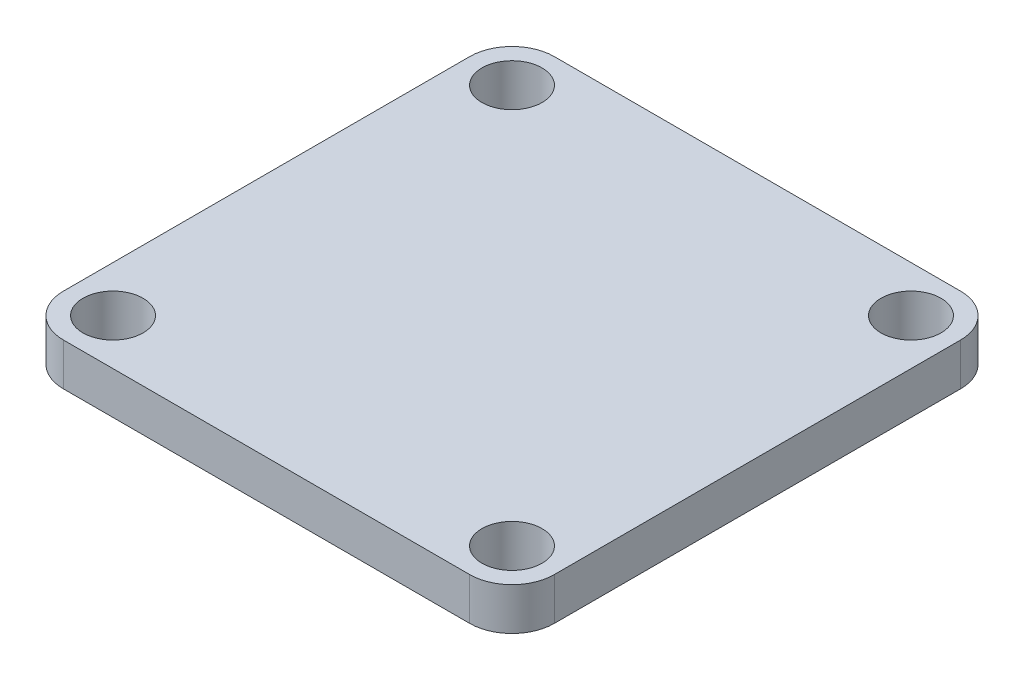
ISO-10303-21;
HEADER;
FILE_DESCRIPTION(('STEP AP214'),'2;1');
FILE_NAME('part.step','',(''),(''),'','','');
FILE_SCHEMA(('AUTOMOTIVE_DESIGN { 1 0 10303 214 1 1 1 1 }'));
ENDSEC;
DATA;
#1=APPLICATION_CONTEXT('core data for automotive mechanical design processes');
#2=APPLICATION_PROTOCOL_DEFINITION('international standard','automotive_design',2000,#1);
#3=PRODUCT_CONTEXT('',#1,'mechanical');
#4=PRODUCT('Part','Part','',(#3));
#5=PRODUCT_RELATED_PRODUCT_CATEGORY('part','',(#4));
#6=PRODUCT_DEFINITION_FORMATION('','',#4);
#7=PRODUCT_DEFINITION_CONTEXT('part definition',#1,'design');
#8=PRODUCT_DEFINITION('design','',#6,#7);
#9=PRODUCT_DEFINITION_SHAPE('','',#8);
#10=(LENGTH_UNIT() NAMED_UNIT(*) SI_UNIT(.MILLI.,.METRE.));
#11=(NAMED_UNIT(*) PLANE_ANGLE_UNIT() SI_UNIT($,.RADIAN.));
#12=(NAMED_UNIT(*) SI_UNIT($,.STERADIAN.) SOLID_ANGLE_UNIT());
#13=UNCERTAINTY_MEASURE_WITH_UNIT(LENGTH_MEASURE(1.E-05),#10,'distance_accuracy_value','');
#14=(GEOMETRIC_REPRESENTATION_CONTEXT(3) GLOBAL_UNCERTAINTY_ASSIGNED_CONTEXT((#13)) GLOBAL_UNIT_ASSIGNED_CONTEXT((#10,
#11,#12)) REPRESENTATION_CONTEXT('',''));
#15=CARTESIAN_POINT('',(0.,0.,0.));
#16=DIRECTION('',(0.,0.,1.));
#17=DIRECTION('',(1.,0.,0.));
#18=AXIS2_PLACEMENT_3D('',#15,#16,#17);
#19=CARTESIAN_POINT('',(0.,5.,0.));
#20=DIRECTION('',(0.,-1.,0.));
#21=DIRECTION('',(0.,0.,-1.));
#22=AXIS2_PLACEMENT_3D('',#19,#20,#21);
#23=PLANE('',#22);
#24=DIRECTION('',(0.,0.,-1.));
#25=VECTOR('',#24,1.);
#26=CARTESIAN_POINT('',(29.,5.,29.));
#27=LINE('',#26,#25);
#28=CARTESIAN_POINT('',(29.,5.,24.));
#29=VERTEX_POINT('',#28);
#30=CARTESIAN_POINT('',(29.,5.,-24.));
#31=VERTEX_POINT('',#30);
#32=EDGE_CURVE('E154',#29,#31,#27,.T.);
#33=ORIENTED_EDGE('',*,*,#32,.T.);
#34=CARTESIAN_POINT('',(24.,5.,-24.));
#35=DIRECTION('',(0.,-1.,0.));
#36=DIRECTION('',(0.,0.,-1.));
#37=AXIS2_PLACEMENT_3D('',#34,#35,#36);
#38=CIRCLE('',#37,5.);
#39=CARTESIAN_POINT('',(24.,5.,-29.));
#40=VERTEX_POINT('',#39);
#41=EDGE_CURVE('E178',#31,#40,#38,.F.);
#42=ORIENTED_EDGE('',*,*,#41,.T.);
#43=DIRECTION('',(-1.,0.,0.));
#44=VECTOR('',#43,1.);
#45=CARTESIAN_POINT('',(-29.,5.,-29.));
#46=LINE('',#45,#44);
#47=CARTESIAN_POINT('',(-24.,5.,-29.));
#48=VERTEX_POINT('',#47);
#49=EDGE_CURVE('E131',#40,#48,#46,.T.);
#50=ORIENTED_EDGE('',*,*,#49,.T.);
#51=CARTESIAN_POINT('',(-24.,5.,-24.));
#52=DIRECTION('',(0.,-1.,0.));
#53=DIRECTION('',(0.,0.,-1.));
#54=AXIS2_PLACEMENT_3D('',#51,#52,#53);
#55=CIRCLE('',#54,5.);
#56=CARTESIAN_POINT('',(-29.,5.,-24.));
#57=VERTEX_POINT('',#56);
#58=EDGE_CURVE('E175',#48,#57,#55,.F.);
#59=ORIENTED_EDGE('',*,*,#58,.T.);
#60=DIRECTION('',(0.,0.,1.));
#61=VECTOR('',#60,1.);
#62=CARTESIAN_POINT('',(-29.,5.,29.));
#63=LINE('',#62,#61);
#64=CARTESIAN_POINT('',(-29.,5.,24.));
#65=VERTEX_POINT('',#64);
#66=EDGE_CURVE('E204',#57,#65,#63,.T.);
#67=ORIENTED_EDGE('',*,*,#66,.T.);
#68=CARTESIAN_POINT('',(-24.,5.,24.));
#69=DIRECTION('',(0.,-1.,0.));
#70=DIRECTION('',(0.,0.,-1.));
#71=AXIS2_PLACEMENT_3D('',#68,#69,#70);
#72=CIRCLE('',#71,5.);
#73=CARTESIAN_POINT('',(-24.,5.,29.));
#74=VERTEX_POINT('',#73);
#75=EDGE_CURVE('E65',#65,#74,#72,.F.);
#76=ORIENTED_EDGE('',*,*,#75,.T.);
#77=DIRECTION('',(1.,0.,0.));
#78=VECTOR('',#77,1.);
#79=CARTESIAN_POINT('',(-29.,5.,29.));
#80=LINE('',#79,#78);
#81=CARTESIAN_POINT('',(24.,5.,29.));
#82=VERTEX_POINT('',#81);
#83=EDGE_CURVE('E156',#74,#82,#80,.T.);
#84=ORIENTED_EDGE('',*,*,#83,.T.);
#85=CARTESIAN_POINT('',(24.,5.,24.));
#86=DIRECTION('',(0.,-1.,0.));
#87=DIRECTION('',(0.,0.,-1.));
#88=AXIS2_PLACEMENT_3D('',#85,#86,#87);
#89=CIRCLE('',#88,5.);
#90=EDGE_CURVE('E172',#82,#29,#89,.F.);
#91=ORIENTED_EDGE('',*,*,#90,.T.);
#92=EDGE_LOOP('',(#33,#42,#50,#59,#67,#76,#84,#91));
#93=FACE_BOUND('',#92,.T.);
#94=CARTESIAN_POINT('',(-23.57,5.,-23.57));
#95=DIRECTION('',(0.,1.,0.));
#96=DIRECTION('',(0.,0.,1.));
#97=AXIS2_PLACEMENT_3D('',#94,#95,#96);
#98=CIRCLE('',#97,3.55);
#99=CARTESIAN_POINT('',(-23.57,5.,-20.02));
#100=VERTEX_POINT('',#99);
#101=EDGE_CURVE('E148',#100,#100,#98,.T.);
#102=ORIENTED_EDGE('',*,*,#101,.F.);
#103=EDGE_LOOP('',(#102));
#104=FACE_BOUND('',#103,.T.);
#105=CARTESIAN_POINT('',(23.57,5.,-23.57));
#106=DIRECTION('',(0.,1.,0.));
#107=DIRECTION('',(0.,0.,1.));
#108=AXIS2_PLACEMENT_3D('',#105,#106,#107);
#109=CIRCLE('',#108,3.55);
#110=CARTESIAN_POINT('',(23.57,5.,-20.02));
#111=VERTEX_POINT('',#110);
#112=EDGE_CURVE('E221',#111,#111,#109,.T.);
#113=ORIENTED_EDGE('',*,*,#112,.F.);
#114=EDGE_LOOP('',(#113));
#115=FACE_BOUND('',#114,.T.);
#116=CARTESIAN_POINT('',(23.57,5.,23.57));
#117=DIRECTION('',(0.,1.,0.));
#118=DIRECTION('',(0.,0.,1.));
#119=AXIS2_PLACEMENT_3D('',#116,#117,#118);
#120=CIRCLE('',#119,3.55);
#121=CARTESIAN_POINT('',(23.57,5.,27.12));
#122=VERTEX_POINT('',#121);
#123=EDGE_CURVE('E225',#122,#122,#120,.T.);
#124=ORIENTED_EDGE('',*,*,#123,.F.);
#125=EDGE_LOOP('',(#124));
#126=FACE_BOUND('',#125,.T.);
#127=CARTESIAN_POINT('',(-23.57,5.,23.57));
#128=DIRECTION('',(0.,1.,0.));
#129=DIRECTION('',(0.,0.,1.));
#130=AXIS2_PLACEMENT_3D('',#127,#128,#129);
#131=CIRCLE('',#130,3.55);
#132=CARTESIAN_POINT('',(-23.57,5.,27.12));
#133=VERTEX_POINT('',#132);
#134=EDGE_CURVE('E228',#133,#133,#131,.T.);
#135=ORIENTED_EDGE('',*,*,#134,.F.);
#136=EDGE_LOOP('',(#135));
#137=FACE_BOUND('',#136,.T.);
#138=ADVANCED_FACE('F44',(#93,#104,#115,#126,#137),#23,.F.);
#139=CARTESIAN_POINT('',(0.,0.,0.));
#140=DIRECTION('',(0.,-1.,0.));
#141=DIRECTION('',(0.,0.,-1.));
#142=AXIS2_PLACEMENT_3D('',#139,#140,#141);
#143=PLANE('',#142);
#144=CARTESIAN_POINT('',(23.57,0.,23.57));
#145=DIRECTION('',(0.,1.,0.));
#146=DIRECTION('',(0.,0.,1.));
#147=AXIS2_PLACEMENT_3D('',#144,#145,#146);
#148=CIRCLE('',#147,3.55);
#149=CARTESIAN_POINT('',(23.57,0.,27.12));
#150=VERTEX_POINT('',#149);
#151=EDGE_CURVE('E231',#150,#150,#148,.T.);
#152=ORIENTED_EDGE('',*,*,#151,.T.);
#153=EDGE_LOOP('',(#152));
#154=FACE_BOUND('',#153,.T.);
#155=CARTESIAN_POINT('',(-23.57,0.,-23.57));
#156=DIRECTION('',(0.,1.,0.));
#157=DIRECTION('',(0.,0.,1.));
#158=AXIS2_PLACEMENT_3D('',#155,#156,#157);
#159=CIRCLE('',#158,3.55);
#160=CARTESIAN_POINT('',(-23.57,0.,-20.02));
#161=VERTEX_POINT('',#160);
#162=EDGE_CURVE('E207',#161,#161,#159,.T.);
#163=ORIENTED_EDGE('',*,*,#162,.T.);
#164=EDGE_LOOP('',(#163));
#165=FACE_BOUND('',#164,.T.);
#166=DIRECTION('',(-1.,0.,0.));
#167=VECTOR('',#166,1.);
#168=CARTESIAN_POINT('',(-29.,0.,-29.));
#169=LINE('',#168,#167);
#170=CARTESIAN_POINT('',(24.,0.,-29.));
#171=VERTEX_POINT('',#170);
#172=CARTESIAN_POINT('',(-24.,0.,-29.));
#173=VERTEX_POINT('',#172);
#174=EDGE_CURVE('E128',#171,#173,#169,.T.);
#175=ORIENTED_EDGE('',*,*,#174,.F.);
#176=CARTESIAN_POINT('',(24.,0.,-24.));
#177=DIRECTION('',(0.,-1.,0.));
#178=DIRECTION('',(0.,0.,-1.));
#179=AXIS2_PLACEMENT_3D('',#176,#177,#178);
#180=CIRCLE('',#179,5.);
#181=CARTESIAN_POINT('',(29.,0.,-24.));
#182=VERTEX_POINT('',#181);
#183=EDGE_CURVE('E110',#171,#182,#180,.T.);
#184=ORIENTED_EDGE('',*,*,#183,.T.);
#185=DIRECTION('',(0.,0.,-1.));
#186=VECTOR('',#185,1.);
#187=CARTESIAN_POINT('',(29.,0.,29.));
#188=LINE('',#187,#186);
#189=CARTESIAN_POINT('',(29.,0.,24.));
#190=VERTEX_POINT('',#189);
#191=EDGE_CURVE('E141',#190,#182,#188,.T.);
#192=ORIENTED_EDGE('',*,*,#191,.F.);
#193=CARTESIAN_POINT('',(24.,0.,24.));
#194=DIRECTION('',(0.,-1.,0.));
#195=DIRECTION('',(0.,0.,-1.));
#196=AXIS2_PLACEMENT_3D('',#193,#194,#195);
#197=CIRCLE('',#196,5.);
#198=CARTESIAN_POINT('',(24.,0.,29.));
#199=VERTEX_POINT('',#198);
#200=EDGE_CURVE('E160',#190,#199,#197,.T.);
#201=ORIENTED_EDGE('',*,*,#200,.T.);
#202=DIRECTION('',(1.,0.,0.));
#203=VECTOR('',#202,1.);
#204=CARTESIAN_POINT('',(-29.,0.,29.));
#205=LINE('',#204,#203);
#206=CARTESIAN_POINT('',(-24.,0.,29.));
#207=VERTEX_POINT('',#206);
#208=EDGE_CURVE('E146',#207,#199,#205,.T.);
#209=ORIENTED_EDGE('',*,*,#208,.F.);
#210=CARTESIAN_POINT('',(-24.,0.,24.));
#211=DIRECTION('',(0.,-1.,0.));
#212=DIRECTION('',(0.,0.,-1.));
#213=AXIS2_PLACEMENT_3D('',#210,#211,#212);
#214=CIRCLE('',#213,5.);
#215=CARTESIAN_POINT('',(-29.,0.,24.));
#216=VERTEX_POINT('',#215);
#217=EDGE_CURVE('E133',#207,#216,#214,.T.);
#218=ORIENTED_EDGE('',*,*,#217,.T.);
#219=DIRECTION('',(0.,0.,1.));
#220=VECTOR('',#219,1.);
#221=CARTESIAN_POINT('',(-29.,0.,29.));
#222=LINE('',#221,#220);
#223=CARTESIAN_POINT('',(-29.,0.,-24.));
#224=VERTEX_POINT('',#223);
#225=EDGE_CURVE('E140',#224,#216,#222,.T.);
#226=ORIENTED_EDGE('',*,*,#225,.F.);
#227=CARTESIAN_POINT('',(-24.,0.,-24.));
#228=DIRECTION('',(0.,-1.,0.));
#229=DIRECTION('',(0.,0.,-1.));
#230=AXIS2_PLACEMENT_3D('',#227,#228,#229);
#231=CIRCLE('',#230,5.);
#232=EDGE_CURVE('E122',#224,#173,#231,.T.);
#233=ORIENTED_EDGE('',*,*,#232,.T.);
#234=EDGE_LOOP('',(#175,#184,#192,#201,#209,#218,#226,#233));
#235=FACE_BOUND('',#234,.T.);
#236=CARTESIAN_POINT('',(23.57,0.,-23.57));
#237=DIRECTION('',(0.,1.,0.));
#238=DIRECTION('',(0.,0.,1.));
#239=AXIS2_PLACEMENT_3D('',#236,#237,#238);
#240=CIRCLE('',#239,3.55);
#241=CARTESIAN_POINT('',(23.57,0.,-20.02));
#242=VERTEX_POINT('',#241);
#243=EDGE_CURVE('E242',#242,#242,#240,.T.);
#244=ORIENTED_EDGE('',*,*,#243,.T.);
#245=EDGE_LOOP('',(#244));
#246=FACE_BOUND('',#245,.T.);
#247=CARTESIAN_POINT('',(-23.57,0.,23.57));
#248=DIRECTION('',(0.,1.,0.));
#249=DIRECTION('',(0.,0.,1.));
#250=AXIS2_PLACEMENT_3D('',#247,#248,#249);
#251=CIRCLE('',#250,3.55);
#252=CARTESIAN_POINT('',(-23.57,0.,27.12));
#253=VERTEX_POINT('',#252);
#254=EDGE_CURVE('E232',#253,#253,#251,.T.);
#255=ORIENTED_EDGE('',*,*,#254,.T.);
#256=EDGE_LOOP('',(#255));
#257=FACE_BOUND('',#256,.T.);
#258=ADVANCED_FACE('F136',(#154,#165,#235,#246,#257),#143,.T.);
#259=CARTESIAN_POINT('',(29.,5.,29.));
#260=DIRECTION('',(-1.,0.,0.));
#261=DIRECTION('',(0.,0.,1.));
#262=AXIS2_PLACEMENT_3D('',#259,#260,#261);
#263=PLANE('',#262);
#264=ORIENTED_EDGE('',*,*,#191,.T.);
#265=DIRECTION('',(0.,-1.,0.));
#266=VECTOR('',#265,1.);
#267=CARTESIAN_POINT('',(29.,5.,-24.));
#268=LINE('',#267,#266);
#269=EDGE_CURVE('E115',#182,#31,#268,.F.);
#270=ORIENTED_EDGE('',*,*,#269,.T.);
#271=ORIENTED_EDGE('',*,*,#32,.F.);
#272=DIRECTION('',(0.,-1.,0.));
#273=VECTOR('',#272,1.);
#274=CARTESIAN_POINT('',(29.,5.,24.));
#275=LINE('',#274,#273);
#276=EDGE_CURVE('E121',#29,#190,#275,.T.);
#277=ORIENTED_EDGE('',*,*,#276,.T.);
#278=EDGE_LOOP('',(#264,#270,#271,#277));
#279=FACE_BOUND('',#278,.T.);
#280=ADVANCED_FACE('F199',(#279),#263,.F.);
#281=CARTESIAN_POINT('',(-29.,5.,-29.));
#282=DIRECTION('',(0.,0.,1.));
#283=DIRECTION('',(1.,0.,0.));
#284=AXIS2_PLACEMENT_3D('',#281,#282,#283);
#285=PLANE('',#284);
#286=ORIENTED_EDGE('',*,*,#49,.F.);
#287=DIRECTION('',(0.,-1.,0.));
#288=VECTOR('',#287,1.);
#289=CARTESIAN_POINT('',(24.,5.,-29.));
#290=LINE('',#289,#288);
#291=EDGE_CURVE('E114',#40,#171,#290,.T.);
#292=ORIENTED_EDGE('',*,*,#291,.T.);
#293=ORIENTED_EDGE('',*,*,#174,.T.);
#294=DIRECTION('',(0.,-1.,0.));
#295=VECTOR('',#294,1.);
#296=CARTESIAN_POINT('',(-24.,5.,-29.));
#297=LINE('',#296,#295);
#298=EDGE_CURVE('E134',#173,#48,#297,.F.);
#299=ORIENTED_EDGE('',*,*,#298,.T.);
#300=EDGE_LOOP('',(#286,#292,#293,#299));
#301=FACE_BOUND('',#300,.T.);
#302=ADVANCED_FACE('F127',(#301),#285,.F.);
#303=CARTESIAN_POINT('',(-29.,5.,29.));
#304=DIRECTION('',(1.,0.,0.));
#305=DIRECTION('',(0.,0.,-1.));
#306=AXIS2_PLACEMENT_3D('',#303,#304,#305);
#307=PLANE('',#306);
#308=ORIENTED_EDGE('',*,*,#66,.F.);
#309=DIRECTION('',(0.,-1.,0.));
#310=VECTOR('',#309,1.);
#311=CARTESIAN_POINT('',(-29.,5.,-24.));
#312=LINE('',#311,#310);
#313=EDGE_CURVE('E184',#57,#224,#312,.T.);
#314=ORIENTED_EDGE('',*,*,#313,.T.);
#315=ORIENTED_EDGE('',*,*,#225,.T.);
#316=DIRECTION('',(0.,-1.,0.));
#317=VECTOR('',#316,1.);
#318=CARTESIAN_POINT('',(-29.,5.,24.));
#319=LINE('',#318,#317);
#320=EDGE_CURVE('E181',#216,#65,#319,.F.);
#321=ORIENTED_EDGE('',*,*,#320,.T.);
#322=EDGE_LOOP('',(#308,#314,#315,#321));
#323=FACE_BOUND('',#322,.T.);
#324=ADVANCED_FACE('F266',(#323),#307,.F.);
#325=CARTESIAN_POINT('',(-29.,5.,29.));
#326=DIRECTION('',(0.,0.,-1.));
#327=DIRECTION('',(-1.,0.,0.));
#328=AXIS2_PLACEMENT_3D('',#325,#326,#327);
#329=PLANE('',#328);
#330=ORIENTED_EDGE('',*,*,#208,.T.);
#331=DIRECTION('',(0.,-1.,0.));
#332=VECTOR('',#331,1.);
#333=CARTESIAN_POINT('',(24.,5.,29.));
#334=LINE('',#333,#332);
#335=EDGE_CURVE('E11',#199,#82,#334,.F.);
#336=ORIENTED_EDGE('',*,*,#335,.T.);
#337=ORIENTED_EDGE('',*,*,#83,.F.);
#338=DIRECTION('',(0.,-1.,0.));
#339=VECTOR('',#338,1.);
#340=CARTESIAN_POINT('',(-24.,5.,29.));
#341=LINE('',#340,#339);
#342=EDGE_CURVE('E53',#74,#207,#341,.T.);
#343=ORIENTED_EDGE('',*,*,#342,.T.);
#344=EDGE_LOOP('',(#330,#336,#337,#343));
#345=FACE_BOUND('',#344,.T.);
#346=ADVANCED_FACE('F191',(#345),#329,.F.);
#347=CARTESIAN_POINT('',(-23.57,5.,-23.57));
#348=DIRECTION('',(0.,-1.,0.));
#349=DIRECTION('',(0.,0.,-1.));
#350=AXIS2_PLACEMENT_3D('',#347,#348,#349);
#351=CYLINDRICAL_SURFACE('',#350,3.55);
#352=ORIENTED_EDGE('',*,*,#101,.T.);
#353=EDGE_LOOP('',(#352));
#354=FACE_BOUND('',#353,.T.);
#355=ORIENTED_EDGE('',*,*,#162,.F.);
#356=EDGE_LOOP('',(#355));
#357=FACE_BOUND('',#356,.T.);
#358=ADVANCED_FACE('F255',(#354,#357),#351,.F.);
#359=CARTESIAN_POINT('',(23.57,5.,-23.57));
#360=DIRECTION('',(0.,-1.,0.));
#361=DIRECTION('',(0.,0.,-1.));
#362=AXIS2_PLACEMENT_3D('',#359,#360,#361);
#363=CYLINDRICAL_SURFACE('',#362,3.55);
#364=ORIENTED_EDGE('',*,*,#112,.T.);
#365=EDGE_LOOP('',(#364));
#366=FACE_BOUND('',#365,.T.);
#367=ORIENTED_EDGE('',*,*,#243,.F.);
#368=EDGE_LOOP('',(#367));
#369=FACE_BOUND('',#368,.T.);
#370=ADVANCED_FACE('F257',(#366,#369),#363,.F.);
#371=CARTESIAN_POINT('',(23.57,5.,23.57));
#372=DIRECTION('',(0.,-1.,0.));
#373=DIRECTION('',(0.,0.,-1.));
#374=AXIS2_PLACEMENT_3D('',#371,#372,#373);
#375=CYLINDRICAL_SURFACE('',#374,3.55);
#376=ORIENTED_EDGE('',*,*,#123,.T.);
#377=EDGE_LOOP('',(#376));
#378=FACE_BOUND('',#377,.T.);
#379=ORIENTED_EDGE('',*,*,#151,.F.);
#380=EDGE_LOOP('',(#379));
#381=FACE_BOUND('',#380,.T.);
#382=ADVANCED_FACE('F262',(#378,#381),#375,.F.);
#383=CARTESIAN_POINT('',(-23.57,5.,23.57));
#384=DIRECTION('',(0.,-1.,0.));
#385=DIRECTION('',(0.,0.,-1.));
#386=AXIS2_PLACEMENT_3D('',#383,#384,#385);
#387=CYLINDRICAL_SURFACE('',#386,3.55);
#388=ORIENTED_EDGE('',*,*,#134,.T.);
#389=EDGE_LOOP('',(#388));
#390=FACE_BOUND('',#389,.T.);
#391=ORIENTED_EDGE('',*,*,#254,.F.);
#392=EDGE_LOOP('',(#391));
#393=FACE_BOUND('',#392,.T.);
#394=ADVANCED_FACE('F283',(#390,#393),#387,.F.);
#395=CARTESIAN_POINT('',(24.,5.,-24.));
#396=DIRECTION('',(0.,-1.,0.));
#397=DIRECTION('',(0.,0.,-1.));
#398=AXIS2_PLACEMENT_3D('',#395,#396,#397);
#399=CYLINDRICAL_SURFACE('',#398,5.);
#400=ORIENTED_EDGE('',*,*,#41,.F.);
#401=ORIENTED_EDGE('',*,*,#269,.F.);
#402=ORIENTED_EDGE('',*,*,#183,.F.);
#403=ORIENTED_EDGE('',*,*,#291,.F.);
#404=EDGE_LOOP('',(#400,#401,#402,#403));
#405=FACE_BOUND('',#404,.T.);
#406=ADVANCED_FACE('F113',(#405),#399,.T.);
#407=CARTESIAN_POINT('',(-24.,5.,-24.));
#408=DIRECTION('',(0.,-1.,0.));
#409=DIRECTION('',(0.,0.,-1.));
#410=AXIS2_PLACEMENT_3D('',#407,#408,#409);
#411=CYLINDRICAL_SURFACE('',#410,5.);
#412=ORIENTED_EDGE('',*,*,#58,.F.);
#413=ORIENTED_EDGE('',*,*,#298,.F.);
#414=ORIENTED_EDGE('',*,*,#232,.F.);
#415=ORIENTED_EDGE('',*,*,#313,.F.);
#416=EDGE_LOOP('',(#412,#413,#414,#415));
#417=FACE_BOUND('',#416,.T.);
#418=ADVANCED_FACE('F282',(#417),#411,.T.);
#419=CARTESIAN_POINT('',(24.,5.,24.));
#420=DIRECTION('',(0.,-1.,0.));
#421=DIRECTION('',(0.,0.,-1.));
#422=AXIS2_PLACEMENT_3D('',#419,#420,#421);
#423=CYLINDRICAL_SURFACE('',#422,5.);
#424=ORIENTED_EDGE('',*,*,#90,.F.);
#425=ORIENTED_EDGE('',*,*,#335,.F.);
#426=ORIENTED_EDGE('',*,*,#200,.F.);
#427=ORIENTED_EDGE('',*,*,#276,.F.);
#428=EDGE_LOOP('',(#424,#425,#426,#427));
#429=FACE_BOUND('',#428,.T.);
#430=ADVANCED_FACE('F196',(#429),#423,.T.);
#431=CARTESIAN_POINT('',(-24.,5.,24.));
#432=DIRECTION('',(0.,-1.,0.));
#433=DIRECTION('',(0.,0.,-1.));
#434=AXIS2_PLACEMENT_3D('',#431,#432,#433);
#435=CYLINDRICAL_SURFACE('',#434,5.);
#436=ORIENTED_EDGE('',*,*,#75,.F.);
#437=ORIENTED_EDGE('',*,*,#320,.F.);
#438=ORIENTED_EDGE('',*,*,#217,.F.);
#439=ORIENTED_EDGE('',*,*,#342,.F.);
#440=EDGE_LOOP('',(#436,#437,#438,#439));
#441=FACE_BOUND('',#440,.T.);
#442=ADVANCED_FACE('F46',(#441),#435,.T.);
#443=CLOSED_SHELL('',(#138,#258,#280,#302,#324,#346,#358,#370,#382,#394,#406,#418,#430,#442));
#444=MANIFOLD_SOLID_BREP('B2',#443);
#445=ADVANCED_BREP_SHAPE_REPRESENTATION('',(#18,#444),#14);
#446=SHAPE_DEFINITION_REPRESENTATION(#9,#445);
ENDSEC;
END-ISO-10303-21;
